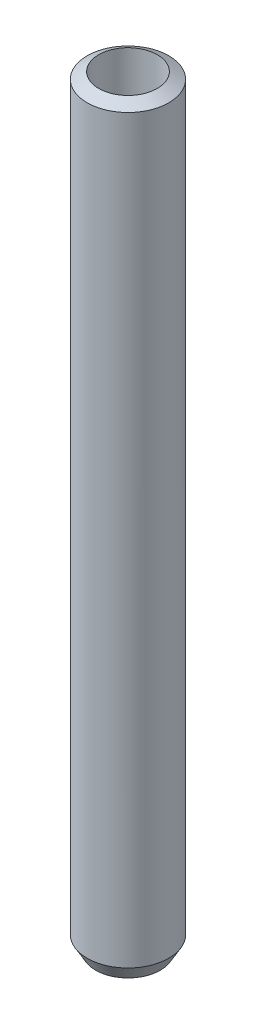
ISO-10303-21;
HEADER;
FILE_DESCRIPTION(('STEP AP214'),'2;1');
FILE_NAME('part.step','',(''),(''),'','','');
FILE_SCHEMA(('AUTOMOTIVE_DESIGN { 1 0 10303 214 1 1 1 1 }'));
ENDSEC;
DATA;
#1=APPLICATION_CONTEXT('core data for automotive mechanical design processes');
#2=APPLICATION_PROTOCOL_DEFINITION('international standard','automotive_design',2000,#1);
#3=PRODUCT_CONTEXT('',#1,'mechanical');
#4=PRODUCT('Part','Part','',(#3));
#5=PRODUCT_RELATED_PRODUCT_CATEGORY('part','',(#4));
#6=PRODUCT_DEFINITION_FORMATION('','',#4);
#7=PRODUCT_DEFINITION_CONTEXT('part definition',#1,'design');
#8=PRODUCT_DEFINITION('design','',#6,#7);
#9=PRODUCT_DEFINITION_SHAPE('','',#8);
#10=(LENGTH_UNIT() NAMED_UNIT(*) SI_UNIT(.MILLI.,.METRE.));
#11=(NAMED_UNIT(*) PLANE_ANGLE_UNIT() SI_UNIT($,.RADIAN.));
#12=(NAMED_UNIT(*) SI_UNIT($,.STERADIAN.) SOLID_ANGLE_UNIT());
#13=UNCERTAINTY_MEASURE_WITH_UNIT(LENGTH_MEASURE(1.E-05),#10,'distance_accuracy_value','');
#14=(GEOMETRIC_REPRESENTATION_CONTEXT(3) GLOBAL_UNCERTAINTY_ASSIGNED_CONTEXT((#13)) GLOBAL_UNIT_ASSIGNED_CONTEXT((#10,
#11,#12)) REPRESENTATION_CONTEXT('',''));
#15=CARTESIAN_POINT('',(0.,0.,0.));
#16=DIRECTION('',(0.,0.,1.));
#17=DIRECTION('',(1.,0.,0.));
#18=AXIS2_PLACEMENT_3D('',#15,#16,#17);
#19=CARTESIAN_POINT('',(0.,234.095435595803,0.));
#20=DIRECTION('',(0.,-1.,0.));
#21=DIRECTION('',(0.,0.,-1.));
#22=AXIS2_PLACEMENT_3D('',#19,#20,#21);
#23=CYLINDRICAL_SURFACE('',#22,12.5);
#24=CARTESIAN_POINT('',(0.,231.511804527471,0.));
#25=DIRECTION('',(0.,1.,0.));
#26=DIRECTION('',(0.,0.,1.));
#27=AXIS2_PLACEMENT_3D('',#24,#25,#26);
#28=CIRCLE('',#27,12.5);
#29=CARTESIAN_POINT('',(0.,231.511804527471,12.5));
#30=VERTEX_POINT('',#29);
#31=EDGE_CURVE('E50',#30,#30,#28,.F.);
#32=ORIENTED_EDGE('',*,*,#31,.T.);
#33=EDGE_LOOP('',(#32));
#34=FACE_BOUND('',#33,.T.);
#35=CARTESIAN_POINT('',(0.,4.47498027836418,0.));
#36=DIRECTION('',(0.,1.,0.));
#37=DIRECTION('',(0.,0.,1.));
#38=AXIS2_PLACEMENT_3D('',#35,#36,#37);
#39=CIRCLE('',#38,12.5);
#40=CARTESIAN_POINT('',(0.,4.47498027836418,12.5));
#41=VERTEX_POINT('',#40);
#42=EDGE_CURVE('E51',#41,#41,#39,.T.);
#43=ORIENTED_EDGE('',*,*,#42,.T.);
#44=EDGE_LOOP('',(#43));
#45=FACE_BOUND('',#44,.T.);
#46=ADVANCED_FACE('F39',(#34,#45),#23,.T.);
#47=CARTESIAN_POINT('',(0.,0.,0.));
#48=DIRECTION('',(0.,1.,0.));
#49=DIRECTION('',(0.,0.,1.));
#50=AXIS2_PLACEMENT_3D('',#47,#48,#49);
#51=PLANE('',#50);
#52=CARTESIAN_POINT('',(0.,0.,0.));
#53=DIRECTION('',(0.,1.,0.));
#54=DIRECTION('',(0.,0.,1.));
#55=AXIS2_PLACEMENT_3D('',#52,#53,#54);
#56=CIRCLE('',#55,9.91636893166814);
#57=CARTESIAN_POINT('',(0.,0.,9.91636893166814));
#58=VERTEX_POINT('',#57);
#59=EDGE_CURVE('E10',#58,#58,#56,.F.);
#60=ORIENTED_EDGE('',*,*,#59,.T.);
#61=EDGE_LOOP('',(#60));
#62=FACE_BOUND('',#61,.T.);
#63=CARTESIAN_POINT('',(0.,0.,0.));
#64=DIRECTION('',(0.,1.,0.));
#65=DIRECTION('',(0.,0.,1.));
#66=AXIS2_PLACEMENT_3D('',#63,#64,#65);
#67=CIRCLE('',#66,8.97266221156938);
#68=CARTESIAN_POINT('',(0.,0.,8.97266221156938));
#69=VERTEX_POINT('',#68);
#70=EDGE_CURVE('E58',#69,#69,#67,.T.);
#71=ORIENTED_EDGE('',*,*,#70,.T.);
#72=EDGE_LOOP('',(#71));
#73=FACE_BOUND('',#72,.T.);
#74=ADVANCED_FACE('F62',(#62,#73),#51,.F.);
#75=CARTESIAN_POINT('',(0.,234.095435595803,0.));
#76=DIRECTION('',(0.,-1.,0.));
#77=DIRECTION('',(0.,0.,-1.));
#78=AXIS2_PLACEMENT_3D('',#75,#76,#77);
#79=CYLINDRICAL_SURFACE('',#78,8.97266221156938);
#80=CARTESIAN_POINT('',(0.,233.548313949145,0.));
#81=DIRECTION('',(0.,-1.,0.));
#82=DIRECTION('',(0.,0.,-1.));
#83=AXIS2_PLACEMENT_3D('',#80,#81,#82);
#84=CIRCLE('',#83,8.97266221156938);
#85=CARTESIAN_POINT('',(0.,233.548313949145,-8.97266221156938));
#86=VERTEX_POINT('',#85);
#87=EDGE_CURVE('E54',#86,#86,#84,.F.);
#88=ORIENTED_EDGE('',*,*,#87,.T.);
#89=EDGE_LOOP('',(#88));
#90=FACE_BOUND('',#89,.T.);
#91=ORIENTED_EDGE('',*,*,#70,.F.);
#92=EDGE_LOOP('',(#91));
#93=FACE_BOUND('',#92,.T.);
#94=ADVANCED_FACE('F68',(#90,#93),#79,.F.);
#95=CARTESIAN_POINT('',(0.,234.095435595803,0.));
#96=DIRECTION('',(0.,-1.,0.));
#97=DIRECTION('',(0.,0.,-1.));
#98=AXIS2_PLACEMENT_3D('',#95,#96,#97);
#99=CONICAL_SURFACE('',#98,8.02501972163567,1.0471975511966);
#100=ORIENTED_EDGE('',*,*,#31,.F.);
#101=EDGE_LOOP('',(#100));
#102=FACE_BOUND('',#101,.T.);
#103=ORIENTED_EDGE('',*,*,#87,.F.);
#104=EDGE_LOOP('',(#103));
#105=FACE_BOUND('',#104,.T.);
#106=ADVANCED_FACE('F66',(#102,#105),#99,.T.);
#107=CARTESIAN_POINT('',(0.,4.47498027836418,0.));
#108=DIRECTION('',(0.,1.,0.));
#109=DIRECTION('',(0.,0.,1.));
#110=AXIS2_PLACEMENT_3D('',#107,#108,#109);
#111=CONICAL_SURFACE('',#110,12.5,0.523598775598304);
#112=ORIENTED_EDGE('',*,*,#59,.F.);
#113=EDGE_LOOP('',(#112));
#114=FACE_BOUND('',#113,.T.);
#115=ORIENTED_EDGE('',*,*,#42,.F.);
#116=EDGE_LOOP('',(#115));
#117=FACE_BOUND('',#116,.T.);
#118=ADVANCED_FACE('F45',(#114,#117),#111,.T.);
#119=CLOSED_SHELL('',(#46,#74,#94,#106,#118));
#120=MANIFOLD_SOLID_BREP('B2',#119);
#121=ADVANCED_BREP_SHAPE_REPRESENTATION('',(#18,#120),#14);
#122=SHAPE_DEFINITION_REPRESENTATION(#9,#121);
ENDSEC;
END-ISO-10303-21;
